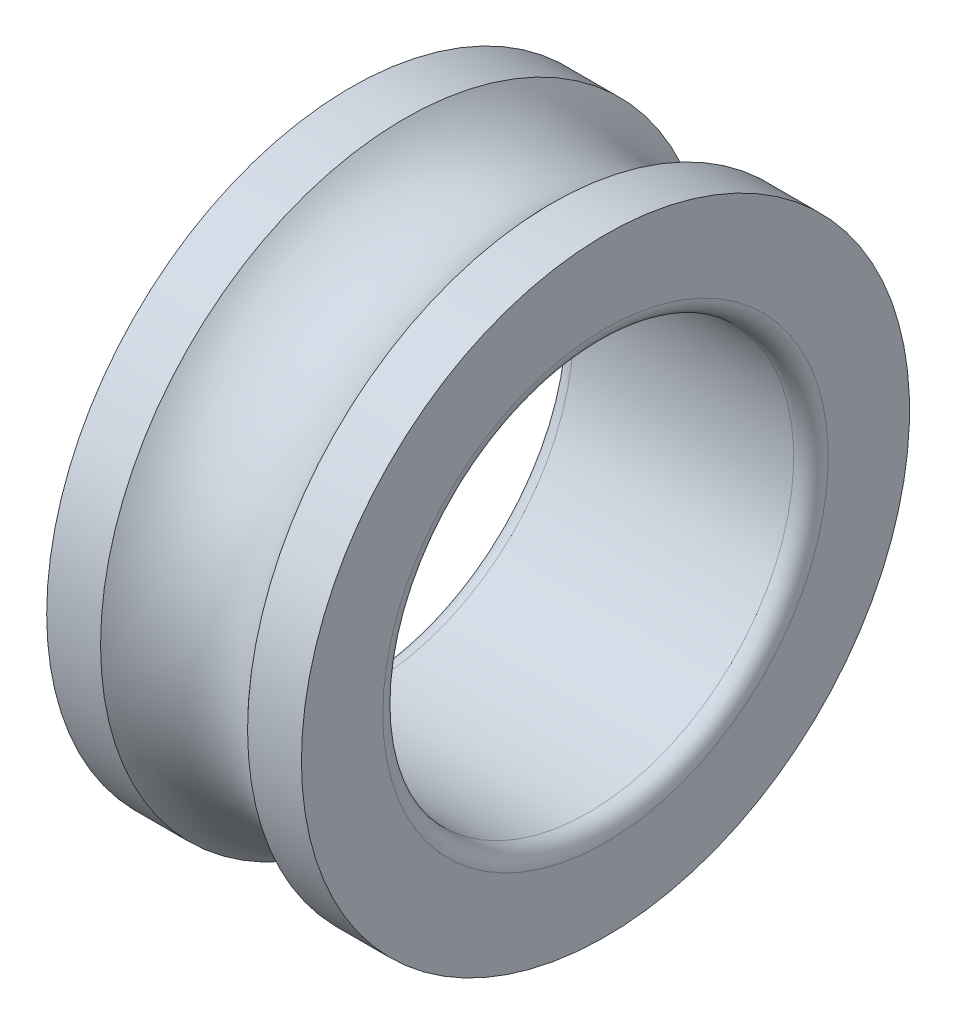
ISO-10303-21;
HEADER;
FILE_DESCRIPTION(('STEP AP214'),'2;1');
FILE_NAME('part.step','',(''),(''),'','','');
FILE_SCHEMA(('AUTOMOTIVE_DESIGN { 1 0 10303 214 1 1 1 1 }'));
ENDSEC;
DATA;
#1=APPLICATION_CONTEXT('core data for automotive mechanical design processes');
#2=APPLICATION_PROTOCOL_DEFINITION('international standard','automotive_design',2000,#1);
#3=PRODUCT_CONTEXT('',#1,'mechanical');
#4=PRODUCT('Part','Part','',(#3));
#5=PRODUCT_RELATED_PRODUCT_CATEGORY('part','',(#4));
#6=PRODUCT_DEFINITION_FORMATION('','',#4);
#7=PRODUCT_DEFINITION_CONTEXT('part definition',#1,'design');
#8=PRODUCT_DEFINITION('design','',#6,#7);
#9=PRODUCT_DEFINITION_SHAPE('','',#8);
#10=(LENGTH_UNIT() NAMED_UNIT(*) SI_UNIT(.MILLI.,.METRE.));
#11=(NAMED_UNIT(*) PLANE_ANGLE_UNIT() SI_UNIT($,.RADIAN.));
#12=(NAMED_UNIT(*) SI_UNIT($,.STERADIAN.) SOLID_ANGLE_UNIT());
#13=UNCERTAINTY_MEASURE_WITH_UNIT(LENGTH_MEASURE(1.E-05),#10,'distance_accuracy_value','');
#14=(GEOMETRIC_REPRESENTATION_CONTEXT(3) GLOBAL_UNCERTAINTY_ASSIGNED_CONTEXT((#13)) GLOBAL_UNIT_ASSIGNED_CONTEXT((#10,
#11,#12)) REPRESENTATION_CONTEXT('',''));
#15=CARTESIAN_POINT('',(0.,0.,0.));
#16=DIRECTION('',(0.,0.,1.));
#17=DIRECTION('',(1.,0.,0.));
#18=AXIS2_PLACEMENT_3D('',#15,#16,#17);
#19=CARTESIAN_POINT('',(-15.5,37.,0.));
#20=DIRECTION('',(1.,0.,0.));
#21=DIRECTION('',(0.,0.,-1.));
#22=AXIS2_PLACEMENT_3D('',#19,#20,#21);
#23=PLANE('',#22);
#24=CARTESIAN_POINT('',(-15.5,0.,0.));
#25=DIRECTION('',(-1.,0.,0.));
#26=DIRECTION('',(0.,0.,1.));
#27=AXIS2_PLACEMENT_3D('',#24,#25,#26);
#28=CIRCLE('',#27,27.1);
#29=CARTESIAN_POINT('',(-15.5,0.,27.1));
#30=VERTEX_POINT('',#29);
#31=EDGE_CURVE('E10',#30,#30,#28,.T.);
#32=ORIENTED_EDGE('',*,*,#31,.F.);
#33=EDGE_LOOP('',(#32));
#34=FACE_BOUND('',#33,.T.);
#35=CARTESIAN_POINT('',(-15.5,0.,0.));
#36=DIRECTION('',(-1.,0.,0.));
#37=DIRECTION('',(0.,0.,1.));
#38=AXIS2_PLACEMENT_3D('',#35,#36,#37);
#39=CIRCLE('',#38,37.);
#40=CARTESIAN_POINT('',(-15.5,0.,37.));
#41=VERTEX_POINT('',#40);
#42=EDGE_CURVE('E76',#41,#41,#39,.T.);
#43=ORIENTED_EDGE('',*,*,#42,.T.);
#44=EDGE_LOOP('',(#43));
#45=FACE_BOUND('',#44,.T.);
#46=ADVANCED_FACE('F41',(#34,#45),#23,.F.);
#47=CARTESIAN_POINT('',(-13.4,0.,0.));
#48=DIRECTION('',(-1.,0.,0.));
#49=DIRECTION('',(0.,0.,1.));
#50=AXIS2_PLACEMENT_3D('',#47,#48,#49);
#51=TOROIDAL_SURFACE('',#50,27.1,2.1);
#52=CARTESIAN_POINT('',(-13.4,0.,0.));
#53=DIRECTION('',(-1.,0.,0.));
#54=DIRECTION('',(0.,0.,1.));
#55=AXIS2_PLACEMENT_3D('',#52,#53,#54);
#56=CIRCLE('',#55,25.);
#57=CARTESIAN_POINT('',(-13.4,0.,25.));
#58=VERTEX_POINT('',#57);
#59=EDGE_CURVE('E48',#58,#58,#56,.T.);
#60=ORIENTED_EDGE('',*,*,#59,.F.);
#61=EDGE_LOOP('',(#60));
#62=FACE_BOUND('',#61,.T.);
#63=ORIENTED_EDGE('',*,*,#31,.T.);
#64=EDGE_LOOP('',(#63));
#65=FACE_BOUND('',#64,.T.);
#66=ADVANCED_FACE('F114',(#62,#65),#51,.T.);
#67=CARTESIAN_POINT('',(-29.5833333333333,0.,0.));
#68=DIRECTION('',(-1.,0.,0.));
#69=DIRECTION('',(0.,0.,1.));
#70=AXIS2_PLACEMENT_3D('',#67,#68,#69);
#71=CYLINDRICAL_SURFACE('',#70,25.);
#72=CARTESIAN_POINT('',(13.4,0.,0.));
#73=DIRECTION('',(-1.,0.,0.));
#74=DIRECTION('',(0.,0.,1.));
#75=AXIS2_PLACEMENT_3D('',#72,#73,#74);
#76=CIRCLE('',#75,25.);
#77=CARTESIAN_POINT('',(13.4,0.,25.));
#78=VERTEX_POINT('',#77);
#79=EDGE_CURVE('E53',#78,#78,#76,.T.);
#80=ORIENTED_EDGE('',*,*,#79,.F.);
#81=EDGE_LOOP('',(#80));
#82=FACE_BOUND('',#81,.T.);
#83=ORIENTED_EDGE('',*,*,#59,.T.);
#84=EDGE_LOOP('',(#83));
#85=FACE_BOUND('',#84,.T.);
#86=ADVANCED_FACE('F109',(#82,#85),#71,.F.);
#87=CARTESIAN_POINT('',(13.4,0.,0.));
#88=DIRECTION('',(-1.,0.,0.));
#89=DIRECTION('',(0.,0.,1.));
#90=AXIS2_PLACEMENT_3D('',#87,#88,#89);
#91=TOROIDAL_SURFACE('',#90,27.1,2.1);
#92=CARTESIAN_POINT('',(15.5,0.,0.));
#93=DIRECTION('',(-1.,0.,0.));
#94=DIRECTION('',(0.,0.,1.));
#95=AXIS2_PLACEMENT_3D('',#92,#93,#94);
#96=CIRCLE('',#95,27.1);
#97=CARTESIAN_POINT('',(15.5,0.,27.1));
#98=VERTEX_POINT('',#97);
#99=EDGE_CURVE('E58',#98,#98,#96,.T.);
#100=ORIENTED_EDGE('',*,*,#99,.F.);
#101=EDGE_LOOP('',(#100));
#102=FACE_BOUND('',#101,.T.);
#103=ORIENTED_EDGE('',*,*,#79,.T.);
#104=EDGE_LOOP('',(#103));
#105=FACE_BOUND('',#104,.T.);
#106=ADVANCED_FACE('F103',(#102,#105),#91,.T.);
#107=CARTESIAN_POINT('',(15.5,37.,0.));
#108=DIRECTION('',(-1.,0.,0.));
#109=DIRECTION('',(0.,0.,1.));
#110=AXIS2_PLACEMENT_3D('',#107,#108,#109);
#111=PLANE('',#110);
#112=CARTESIAN_POINT('',(15.5,0.,0.));
#113=DIRECTION('',(-1.,0.,0.));
#114=DIRECTION('',(0.,0.,1.));
#115=AXIS2_PLACEMENT_3D('',#112,#113,#114);
#116=CIRCLE('',#115,37.);
#117=CARTESIAN_POINT('',(15.5,0.,37.));
#118=VERTEX_POINT('',#117);
#119=EDGE_CURVE('E64',#118,#118,#116,.T.);
#120=ORIENTED_EDGE('',*,*,#119,.F.);
#121=EDGE_LOOP('',(#120));
#122=FACE_BOUND('',#121,.T.);
#123=ORIENTED_EDGE('',*,*,#99,.T.);
#124=EDGE_LOOP('',(#123));
#125=FACE_BOUND('',#124,.T.);
#126=ADVANCED_FACE('F97',(#122,#125),#111,.F.);
#127=CARTESIAN_POINT('',(-29.5833333333333,0.,0.));
#128=DIRECTION('',(-1.,0.,0.));
#129=DIRECTION('',(0.,0.,1.));
#130=AXIS2_PLACEMENT_3D('',#127,#128,#129);
#131=CYLINDRICAL_SURFACE('',#130,37.);
#132=CARTESIAN_POINT('',(8.94427190999916,0.,0.));
#133=DIRECTION('',(-1.,0.,0.));
#134=DIRECTION('',(0.,0.,1.));
#135=AXIS2_PLACEMENT_3D('',#132,#133,#134);
#136=CIRCLE('',#135,37.);
#137=CARTESIAN_POINT('',(8.94427190999916,0.,37.));
#138=VERTEX_POINT('',#137);
#139=EDGE_CURVE('E68',#138,#138,#136,.T.);
#140=ORIENTED_EDGE('',*,*,#139,.F.);
#141=EDGE_LOOP('',(#140));
#142=FACE_BOUND('',#141,.T.);
#143=ORIENTED_EDGE('',*,*,#119,.T.);
#144=EDGE_LOOP('',(#143));
#145=FACE_BOUND('',#144,.T.);
#146=ADVANCED_FACE('F91',(#142,#145),#131,.T.);
#147=CARTESIAN_POINT('',(0.,0.,0.));
#148=DIRECTION('',(-1.,0.,0.));
#149=DIRECTION('',(0.,0.,1.));
#150=AXIS2_PLACEMENT_3D('',#147,#148,#149);
#151=TOROIDAL_SURFACE('',#150,45.,12.);
#152=CARTESIAN_POINT('',(-8.94427190999916,0.,0.));
#153=DIRECTION('',(-1.,0.,0.));
#154=DIRECTION('',(0.,0.,1.));
#155=AXIS2_PLACEMENT_3D('',#152,#153,#154);
#156=CIRCLE('',#155,37.);
#157=CARTESIAN_POINT('',(-8.94427190999916,0.,37.));
#158=VERTEX_POINT('',#157);
#159=EDGE_CURVE('E72',#158,#158,#156,.T.);
#160=ORIENTED_EDGE('',*,*,#159,.F.);
#161=EDGE_LOOP('',(#160));
#162=FACE_BOUND('',#161,.T.);
#163=ORIENTED_EDGE('',*,*,#139,.T.);
#164=EDGE_LOOP('',(#163));
#165=FACE_BOUND('',#164,.T.);
#166=ADVANCED_FACE('F85',(#162,#165),#151,.F.);
#167=CARTESIAN_POINT('',(-29.5833333333333,0.,0.));
#168=DIRECTION('',(-1.,0.,0.));
#169=DIRECTION('',(0.,0.,1.));
#170=AXIS2_PLACEMENT_3D('',#167,#168,#169);
#171=CYLINDRICAL_SURFACE('',#170,37.);
#172=ORIENTED_EDGE('',*,*,#42,.F.);
#173=EDGE_LOOP('',(#172));
#174=FACE_BOUND('',#173,.T.);
#175=ORIENTED_EDGE('',*,*,#159,.T.);
#176=EDGE_LOOP('',(#175));
#177=FACE_BOUND('',#176,.T.);
#178=ADVANCED_FACE('F82',(#174,#177),#171,.T.);
#179=CLOSED_SHELL('',(#46,#66,#86,#106,#126,#146,#166,#178));
#180=MANIFOLD_SOLID_BREP('B2',#179);
#181=ADVANCED_BREP_SHAPE_REPRESENTATION('',(#18,#180),#14);
#182=SHAPE_DEFINITION_REPRESENTATION(#9,#181);
ENDSEC;
END-ISO-10303-21;
